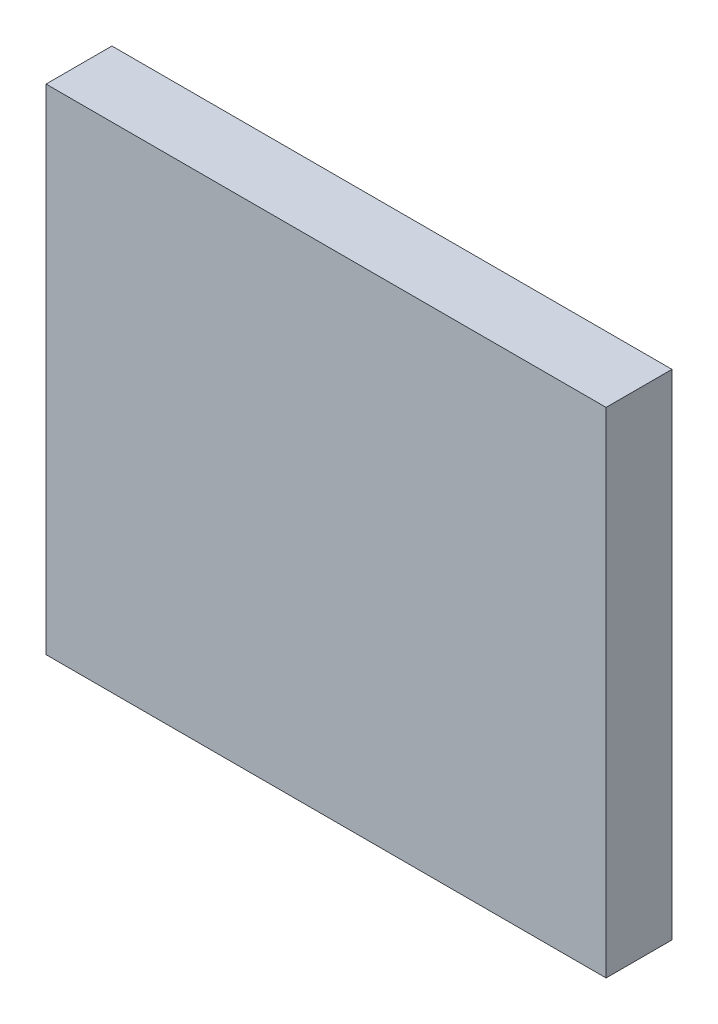
ISO-10303-21;
HEADER;
FILE_DESCRIPTION(('STEP AP214'),'2;1');
FILE_NAME('part.step','',(''),(''),'','','');
FILE_SCHEMA(('AUTOMOTIVE_DESIGN { 1 0 10303 214 1 1 1 1 }'));
ENDSEC;
DATA;
#1=APPLICATION_CONTEXT('core data for automotive mechanical design processes');
#2=APPLICATION_PROTOCOL_DEFINITION('international standard','automotive_design',2000,#1);
#3=PRODUCT_CONTEXT('',#1,'mechanical');
#4=PRODUCT('Part','Part','',(#3));
#5=PRODUCT_RELATED_PRODUCT_CATEGORY('part','',(#4));
#6=PRODUCT_DEFINITION_FORMATION('','',#4);
#7=PRODUCT_DEFINITION_CONTEXT('part definition',#1,'design');
#8=PRODUCT_DEFINITION('design','',#6,#7);
#9=PRODUCT_DEFINITION_SHAPE('','',#8);
#10=(LENGTH_UNIT() NAMED_UNIT(*) SI_UNIT(.MILLI.,.METRE.));
#11=(NAMED_UNIT(*) PLANE_ANGLE_UNIT() SI_UNIT($,.RADIAN.));
#12=(NAMED_UNIT(*) SI_UNIT($,.STERADIAN.) SOLID_ANGLE_UNIT());
#13=UNCERTAINTY_MEASURE_WITH_UNIT(LENGTH_MEASURE(1.E-05),#10,'distance_accuracy_value','');
#14=(GEOMETRIC_REPRESENTATION_CONTEXT(3) GLOBAL_UNCERTAINTY_ASSIGNED_CONTEXT((#13)) GLOBAL_UNIT_ASSIGNED_CONTEXT((#10,
#11,#12)) REPRESENTATION_CONTEXT('',''));
#15=CARTESIAN_POINT('',(0.,0.,0.));
#16=DIRECTION('',(0.,0.,1.));
#17=DIRECTION('',(1.,0.,0.));
#18=AXIS2_PLACEMENT_3D('',#15,#16,#17);
#19=CARTESIAN_POINT('',(0.,15.,0.));
#20=DIRECTION('',(1.,0.,0.));
#21=DIRECTION('',(0.,0.,-1.));
#22=AXIS2_PLACEMENT_3D('',#19,#20,#21);
#23=PLANE('',#22);
#24=DIRECTION('',(0.,0.,1.));
#25=VECTOR('',#24,1.);
#26=CARTESIAN_POINT('',(0.,0.,0.));
#27=LINE('',#26,#25);
#28=CARTESIAN_POINT('',(0.,0.,-2.));
#29=VERTEX_POINT('',#28);
#30=CARTESIAN_POINT('',(0.,0.,0.));
#31=VERTEX_POINT('',#30);
#32=EDGE_CURVE('E96',#29,#31,#27,.T.);
#33=ORIENTED_EDGE('',*,*,#32,.T.);
#34=DIRECTION('',(0.,-1.,0.));
#35=VECTOR('',#34,1.);
#36=CARTESIAN_POINT('',(0.,15.,0.));
#37=LINE('',#36,#35);
#38=CARTESIAN_POINT('',(0.,15.,0.));
#39=VERTEX_POINT('',#38);
#40=EDGE_CURVE('E11',#39,#31,#37,.T.);
#41=ORIENTED_EDGE('',*,*,#40,.F.);
#42=DIRECTION('',(0.,0.,1.));
#43=VECTOR('',#42,1.);
#44=CARTESIAN_POINT('',(0.,15.,0.));
#45=LINE('',#44,#43);
#46=CARTESIAN_POINT('',(0.,15.,-2.));
#47=VERTEX_POINT('',#46);
#48=EDGE_CURVE('E84',#47,#39,#45,.T.);
#49=ORIENTED_EDGE('',*,*,#48,.F.);
#50=DIRECTION('',(0.,-1.,0.));
#51=VECTOR('',#50,1.);
#52=CARTESIAN_POINT('',(0.,15.,-2.));
#53=LINE('',#52,#51);
#54=EDGE_CURVE('E92',#47,#29,#53,.T.);
#55=ORIENTED_EDGE('',*,*,#54,.T.);
#56=EDGE_LOOP('',(#33,#41,#49,#55));
#57=FACE_BOUND('',#56,.T.);
#58=ADVANCED_FACE('F33',(#57),#23,.F.);
#59=CARTESIAN_POINT('',(0.,15.,0.));
#60=DIRECTION('',(0.,0.,-1.));
#61=DIRECTION('',(-1.,0.,0.));
#62=AXIS2_PLACEMENT_3D('',#59,#60,#61);
#63=PLANE('',#62);
#64=DIRECTION('',(1.,0.,0.));
#65=VECTOR('',#64,1.);
#66=CARTESIAN_POINT('',(0.,0.,0.));
#67=LINE('',#66,#65);
#68=CARTESIAN_POINT('',(17.,0.,0.));
#69=VERTEX_POINT('',#68);
#70=EDGE_CURVE('E88',#31,#69,#67,.T.);
#71=ORIENTED_EDGE('',*,*,#70,.T.);
#72=DIRECTION('',(0.,-1.,0.));
#73=VECTOR('',#72,1.);
#74=CARTESIAN_POINT('',(17.,15.,0.));
#75=LINE('',#74,#73);
#76=CARTESIAN_POINT('',(17.,15.,0.));
#77=VERTEX_POINT('',#76);
#78=EDGE_CURVE('E41',#77,#69,#75,.T.);
#79=ORIENTED_EDGE('',*,*,#78,.F.);
#80=DIRECTION('',(1.,0.,0.));
#81=VECTOR('',#80,1.);
#82=CARTESIAN_POINT('',(0.,15.,0.));
#83=LINE('',#82,#81);
#84=EDGE_CURVE('E79',#39,#77,#83,.T.);
#85=ORIENTED_EDGE('',*,*,#84,.F.);
#86=ORIENTED_EDGE('',*,*,#40,.T.);
#87=EDGE_LOOP('',(#71,#79,#85,#86));
#88=FACE_BOUND('',#87,.T.);
#89=ADVANCED_FACE('F87',(#88),#63,.F.);
#90=CARTESIAN_POINT('',(17.,15.,0.));
#91=DIRECTION('',(-1.,0.,0.));
#92=DIRECTION('',(0.,0.,1.));
#93=AXIS2_PLACEMENT_3D('',#90,#91,#92);
#94=PLANE('',#93);
#95=DIRECTION('',(0.,0.,-1.));
#96=VECTOR('',#95,1.);
#97=CARTESIAN_POINT('',(17.,0.,0.));
#98=LINE('',#97,#96);
#99=CARTESIAN_POINT('',(17.,0.,-2.));
#100=VERTEX_POINT('',#99);
#101=EDGE_CURVE('E66',#69,#100,#98,.T.);
#102=ORIENTED_EDGE('',*,*,#101,.T.);
#103=DIRECTION('',(0.,-1.,0.));
#104=VECTOR('',#103,1.);
#105=CARTESIAN_POINT('',(17.,15.,-2.));
#106=LINE('',#105,#104);
#107=CARTESIAN_POINT('',(17.,15.,-2.));
#108=VERTEX_POINT('',#107);
#109=EDGE_CURVE('E89',#108,#100,#106,.T.);
#110=ORIENTED_EDGE('',*,*,#109,.F.);
#111=DIRECTION('',(0.,0.,-1.));
#112=VECTOR('',#111,1.);
#113=CARTESIAN_POINT('',(17.,15.,0.));
#114=LINE('',#113,#112);
#115=EDGE_CURVE('E82',#77,#108,#114,.T.);
#116=ORIENTED_EDGE('',*,*,#115,.F.);
#117=ORIENTED_EDGE('',*,*,#78,.T.);
#118=EDGE_LOOP('',(#102,#110,#116,#117));
#119=FACE_BOUND('',#118,.T.);
#120=ADVANCED_FACE('F90',(#119),#94,.F.);
#121=CARTESIAN_POINT('',(0.,15.,-2.));
#122=DIRECTION('',(0.,0.,1.));
#123=DIRECTION('',(1.,0.,0.));
#124=AXIS2_PLACEMENT_3D('',#121,#122,#123);
#125=PLANE('',#124);
#126=DIRECTION('',(-1.,0.,0.));
#127=VECTOR('',#126,1.);
#128=CARTESIAN_POINT('',(0.,0.,-2.));
#129=LINE('',#128,#127);
#130=EDGE_CURVE('E72',#100,#29,#129,.T.);
#131=ORIENTED_EDGE('',*,*,#130,.T.);
#132=ORIENTED_EDGE('',*,*,#54,.F.);
#133=DIRECTION('',(-1.,0.,0.));
#134=VECTOR('',#133,1.);
#135=CARTESIAN_POINT('',(0.,15.,-2.));
#136=LINE('',#135,#134);
#137=EDGE_CURVE('E49',#108,#47,#136,.T.);
#138=ORIENTED_EDGE('',*,*,#137,.F.);
#139=ORIENTED_EDGE('',*,*,#109,.T.);
#140=EDGE_LOOP('',(#131,#132,#138,#139));
#141=FACE_BOUND('',#140,.T.);
#142=ADVANCED_FACE('F103',(#141),#125,.F.);
#143=CARTESIAN_POINT('',(0.,15.,0.));
#144=DIRECTION('',(0.,-1.,0.));
#145=DIRECTION('',(0.,0.,-1.));
#146=AXIS2_PLACEMENT_3D('',#143,#144,#145);
#147=PLANE('',#146);
#148=ORIENTED_EDGE('',*,*,#48,.T.);
#149=ORIENTED_EDGE('',*,*,#84,.T.);
#150=ORIENTED_EDGE('',*,*,#115,.T.);
#151=ORIENTED_EDGE('',*,*,#137,.T.);
#152=EDGE_LOOP('',(#148,#149,#150,#151));
#153=FACE_BOUND('',#152,.T.);
#154=ADVANCED_FACE('F80',(#153),#147,.F.);
#155=CARTESIAN_POINT('',(0.,0.,0.));
#156=DIRECTION('',(0.,-1.,0.));
#157=DIRECTION('',(0.,0.,-1.));
#158=AXIS2_PLACEMENT_3D('',#155,#156,#157);
#159=PLANE('',#158);
#160=ORIENTED_EDGE('',*,*,#32,.F.);
#161=ORIENTED_EDGE('',*,*,#130,.F.);
#162=ORIENTED_EDGE('',*,*,#101,.F.);
#163=ORIENTED_EDGE('',*,*,#70,.F.);
#164=EDGE_LOOP('',(#160,#161,#162,#163));
#165=FACE_BOUND('',#164,.T.);
#166=ADVANCED_FACE('F106',(#165),#159,.T.);
#167=CLOSED_SHELL('',(#58,#89,#120,#142,#154,#166));
#168=MANIFOLD_SOLID_BREP('B2',#167);
#169=ADVANCED_BREP_SHAPE_REPRESENTATION('',(#18,#168),#14);
#170=SHAPE_DEFINITION_REPRESENTATION(#9,#169);
ENDSEC;
END-ISO-10303-21;
